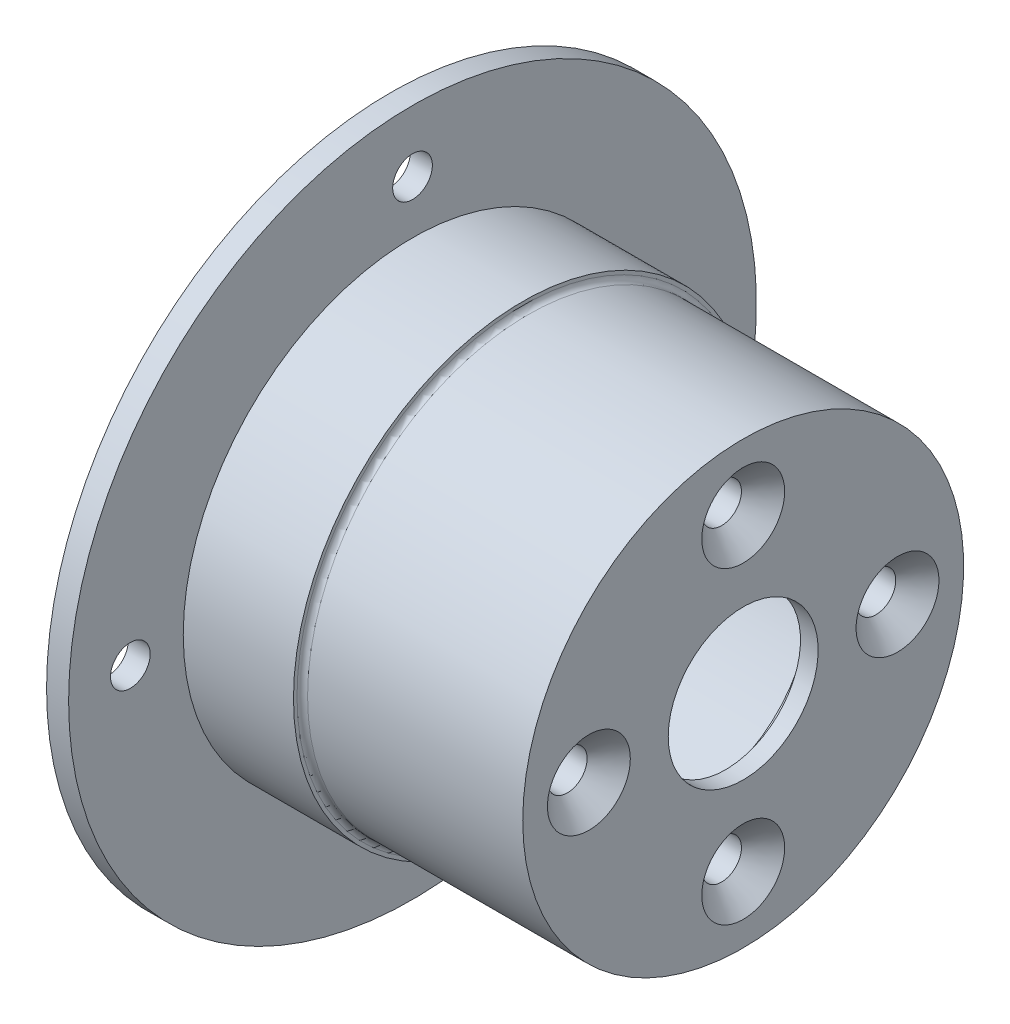
ISO-10303-21;
HEADER;
FILE_DESCRIPTION(('STEP AP214'),'2;1');
FILE_NAME('part.step','',(''),(''),'','','');
FILE_SCHEMA(('AUTOMOTIVE_DESIGN { 1 0 10303 214 1 1 1 1 }'));
ENDSEC;
DATA;
#1=APPLICATION_CONTEXT('core data for automotive mechanical design processes');
#2=APPLICATION_PROTOCOL_DEFINITION('international standard','automotive_design',2000,#1);
#3=PRODUCT_CONTEXT('',#1,'mechanical');
#4=PRODUCT('Part','Part','',(#3));
#5=PRODUCT_RELATED_PRODUCT_CATEGORY('part','',(#4));
#6=PRODUCT_DEFINITION_FORMATION('','',#4);
#7=PRODUCT_DEFINITION_CONTEXT('part definition',#1,'design');
#8=PRODUCT_DEFINITION('design','',#6,#7);
#9=PRODUCT_DEFINITION_SHAPE('','',#8);
#10=(LENGTH_UNIT() NAMED_UNIT(*) SI_UNIT(.MILLI.,.METRE.));
#11=(NAMED_UNIT(*) PLANE_ANGLE_UNIT() SI_UNIT($,.RADIAN.));
#12=(NAMED_UNIT(*) SI_UNIT($,.STERADIAN.) SOLID_ANGLE_UNIT());
#13=UNCERTAINTY_MEASURE_WITH_UNIT(LENGTH_MEASURE(1.E-05),#10,'distance_accuracy_value','');
#14=(GEOMETRIC_REPRESENTATION_CONTEXT(3) GLOBAL_UNCERTAINTY_ASSIGNED_CONTEXT((#13)) GLOBAL_UNIT_ASSIGNED_CONTEXT((#10,
#11,#12)) REPRESENTATION_CONTEXT('',''));
#15=CARTESIAN_POINT('',(0.,0.,0.));
#16=DIRECTION('',(0.,0.,1.));
#17=DIRECTION('',(1.,0.,0.));
#18=AXIS2_PLACEMENT_3D('',#15,#16,#17);
#19=CARTESIAN_POINT('',(0.,39.,0.));
#20=DIRECTION('',(1.,0.,0.));
#21=DIRECTION('',(0.,0.,-1.));
#22=AXIS2_PLACEMENT_3D('',#19,#20,#21);
#23=PLANE('',#22);
#24=CARTESIAN_POINT('',(0.,-32.,0.));
#25=DIRECTION('',(-1.,0.,0.));
#26=DIRECTION('',(0.,0.,1.));
#27=AXIS2_PLACEMENT_3D('',#24,#25,#26);
#28=CIRCLE('',#27,2.25);
#29=CARTESIAN_POINT('',(0.,-32.,2.25));
#30=VERTEX_POINT('',#29);
#31=EDGE_CURVE('E165',#30,#30,#28,.T.);
#32=ORIENTED_EDGE('',*,*,#31,.F.);
#33=EDGE_LOOP('',(#32));
#34=FACE_BOUND('',#33,.T.);
#35=CARTESIAN_POINT('',(0.,0.,-32.));
#36=DIRECTION('',(-1.,0.,0.));
#37=DIRECTION('',(0.,0.,1.));
#38=AXIS2_PLACEMENT_3D('',#35,#36,#37);
#39=CIRCLE('',#38,2.25);
#40=CARTESIAN_POINT('',(0.,0.,-29.75));
#41=VERTEX_POINT('',#40);
#42=EDGE_CURVE('E149',#41,#41,#39,.T.);
#43=ORIENTED_EDGE('',*,*,#42,.F.);
#44=EDGE_LOOP('',(#43));
#45=FACE_BOUND('',#44,.T.);
#46=CARTESIAN_POINT('',(0.,0.,0.));
#47=DIRECTION('',(-1.,0.,0.));
#48=DIRECTION('',(0.,0.,1.));
#49=AXIS2_PLACEMENT_3D('',#46,#47,#48);
#50=CIRCLE('',#49,21.);
#51=CARTESIAN_POINT('',(0.,0.,21.));
#52=VERTEX_POINT('',#51);
#53=EDGE_CURVE('E50',#52,#52,#50,.T.);
#54=ORIENTED_EDGE('',*,*,#53,.F.);
#55=EDGE_LOOP('',(#54));
#56=FACE_BOUND('',#55,.T.);
#57=CARTESIAN_POINT('',(0.,0.,0.));
#58=DIRECTION('',(-1.,0.,0.));
#59=DIRECTION('',(0.,0.,1.));
#60=AXIS2_PLACEMENT_3D('',#57,#58,#59);
#61=CIRCLE('',#60,39.);
#62=CARTESIAN_POINT('',(0.,0.,39.));
#63=VERTEX_POINT('',#62);
#64=EDGE_CURVE('E93',#63,#63,#61,.T.);
#65=ORIENTED_EDGE('',*,*,#64,.T.);
#66=EDGE_LOOP('',(#65));
#67=FACE_BOUND('',#66,.T.);
#68=CARTESIAN_POINT('',(0.,0.,32.));
#69=DIRECTION('',(-1.,0.,0.));
#70=DIRECTION('',(0.,0.,1.));
#71=AXIS2_PLACEMENT_3D('',#68,#69,#70);
#72=CIRCLE('',#71,2.25);
#73=CARTESIAN_POINT('',(0.,0.,34.25));
#74=VERTEX_POINT('',#73);
#75=EDGE_CURVE('E157',#74,#74,#72,.T.);
#76=ORIENTED_EDGE('',*,*,#75,.F.);
#77=EDGE_LOOP('',(#76));
#78=FACE_BOUND('',#77,.T.);
#79=CARTESIAN_POINT('',(0.,32.,0.));
#80=DIRECTION('',(-1.,0.,0.));
#81=DIRECTION('',(0.,0.,1.));
#82=AXIS2_PLACEMENT_3D('',#79,#80,#81);
#83=CIRCLE('',#82,2.25);
#84=CARTESIAN_POINT('',(0.,32.,2.25));
#85=VERTEX_POINT('',#84);
#86=EDGE_CURVE('E173',#85,#85,#83,.T.);
#87=ORIENTED_EDGE('',*,*,#86,.F.);
#88=EDGE_LOOP('',(#87));
#89=FACE_BOUND('',#88,.T.);
#90=ADVANCED_FACE('F37',(#34,#45,#56,#67,#78,#89),#23,.F.);
#91=CARTESIAN_POINT('',(-64.1033524540557,0.,0.));
#92=DIRECTION('',(-1.,0.,0.));
#93=DIRECTION('',(0.,0.,1.));
#94=AXIS2_PLACEMENT_3D('',#91,#92,#93);
#95=CYLINDRICAL_SURFACE('',#94,21.);
#96=CARTESIAN_POINT('',(35.,0.,0.));
#97=DIRECTION('',(-1.,0.,0.));
#98=DIRECTION('',(0.,0.,1.));
#99=AXIS2_PLACEMENT_3D('',#96,#97,#98);
#100=CIRCLE('',#99,21.);
#101=CARTESIAN_POINT('',(35.,0.,21.));
#102=VERTEX_POINT('',#101);
#103=EDGE_CURVE('E55',#102,#102,#100,.T.);
#104=ORIENTED_EDGE('',*,*,#103,.F.);
#105=EDGE_LOOP('',(#104));
#106=FACE_BOUND('',#105,.T.);
#107=ORIENTED_EDGE('',*,*,#53,.T.);
#108=EDGE_LOOP('',(#107));
#109=FACE_BOUND('',#108,.T.);
#110=ADVANCED_FACE('F181',(#106,#109),#95,.F.);
#111=CARTESIAN_POINT('',(35.,21.,0.));
#112=DIRECTION('',(1.,0.,0.));
#113=DIRECTION('',(0.,0.,-1.));
#114=AXIS2_PLACEMENT_3D('',#111,#112,#113);
#115=PLANE('',#114);
#116=CARTESIAN_POINT('',(35.,17.5,0.));
#117=DIRECTION('',(1.,0.,0.));
#118=DIRECTION('',(0.,0.,-1.));
#119=AXIS2_PLACEMENT_3D('',#116,#117,#118);
#120=CIRCLE('',#119,2.24999999999999);
#121=CARTESIAN_POINT('',(35.,17.5,-2.24999999999999));
#122=VERTEX_POINT('',#121);
#123=EDGE_CURVE('E133',#122,#122,#120,.T.);
#124=ORIENTED_EDGE('',*,*,#123,.T.);
#125=EDGE_LOOP('',(#124));
#126=FACE_BOUND('',#125,.T.);
#127=CARTESIAN_POINT('',(35.,0.,-17.5));
#128=DIRECTION('',(1.,0.,0.));
#129=DIRECTION('',(0.,0.,-1.));
#130=AXIS2_PLACEMENT_3D('',#127,#128,#129);
#131=CIRCLE('',#130,2.24999999999999);
#132=CARTESIAN_POINT('',(35.,0.,-19.75));
#133=VERTEX_POINT('',#132);
#134=EDGE_CURVE('E121',#133,#133,#131,.T.);
#135=ORIENTED_EDGE('',*,*,#134,.T.);
#136=EDGE_LOOP('',(#135));
#137=FACE_BOUND('',#136,.T.);
#138=CARTESIAN_POINT('',(35.,-17.5,0.));
#139=DIRECTION('',(1.,0.,0.));
#140=DIRECTION('',(0.,0.,-1.));
#141=AXIS2_PLACEMENT_3D('',#138,#139,#140);
#142=CIRCLE('',#141,2.24999999999999);
#143=CARTESIAN_POINT('',(35.,-17.5,-2.24999999999999));
#144=VERTEX_POINT('',#143);
#145=EDGE_CURVE('E109',#144,#144,#142,.T.);
#146=ORIENTED_EDGE('',*,*,#145,.T.);
#147=EDGE_LOOP('',(#146));
#148=FACE_BOUND('',#147,.T.);
#149=CARTESIAN_POINT('',(35.,0.,17.5));
#150=DIRECTION('',(1.,0.,0.));
#151=DIRECTION('',(0.,0.,-1.));
#152=AXIS2_PLACEMENT_3D('',#149,#150,#151);
#153=CIRCLE('',#152,2.24999999999999);
#154=CARTESIAN_POINT('',(35.,0.,15.25));
#155=VERTEX_POINT('',#154);
#156=EDGE_CURVE('E97',#155,#155,#153,.T.);
#157=ORIENTED_EDGE('',*,*,#156,.T.);
#158=EDGE_LOOP('',(#157));
#159=FACE_BOUND('',#158,.T.);
#160=CARTESIAN_POINT('',(35.,0.,0.));
#161=DIRECTION('',(-1.,0.,0.));
#162=DIRECTION('',(0.,0.,1.));
#163=AXIS2_PLACEMENT_3D('',#160,#161,#162);
#164=CIRCLE('',#163,12.5);
#165=CARTESIAN_POINT('',(35.,0.,12.5));
#166=VERTEX_POINT('',#165);
#167=EDGE_CURVE('E61',#166,#166,#164,.T.);
#168=ORIENTED_EDGE('',*,*,#167,.F.);
#169=EDGE_LOOP('',(#168));
#170=FACE_BOUND('',#169,.T.);
#171=ORIENTED_EDGE('',*,*,#103,.T.);
#172=EDGE_LOOP('',(#171));
#173=FACE_BOUND('',#172,.T.);
#174=ADVANCED_FACE('F187',(#126,#137,#148,#159,#170,#173),#115,.F.);
#175=CARTESIAN_POINT('',(-64.1033524540557,0.,0.));
#176=DIRECTION('',(-1.,0.,0.));
#177=DIRECTION('',(0.,0.,1.));
#178=AXIS2_PLACEMENT_3D('',#175,#176,#177);
#179=CYLINDRICAL_SURFACE('',#178,12.5);
#180=CARTESIAN_POINT('',(38.,0.,0.));
#181=DIRECTION('',(-1.,0.,0.));
#182=DIRECTION('',(0.,0.,1.));
#183=AXIS2_PLACEMENT_3D('',#180,#181,#182);
#184=CIRCLE('',#183,12.5);
#185=CARTESIAN_POINT('',(38.,0.,12.5));
#186=VERTEX_POINT('',#185);
#187=EDGE_CURVE('E65',#186,#186,#184,.T.);
#188=ORIENTED_EDGE('',*,*,#187,.F.);
#189=EDGE_LOOP('',(#188));
#190=FACE_BOUND('',#189,.T.);
#191=ORIENTED_EDGE('',*,*,#167,.T.);
#192=EDGE_LOOP('',(#191));
#193=FACE_BOUND('',#192,.T.);
#194=ADVANCED_FACE('F224',(#190,#193),#179,.F.);
#195=CARTESIAN_POINT('',(38.,12.5,0.));
#196=DIRECTION('',(1.,0.,0.));
#197=DIRECTION('',(0.,0.,-1.));
#198=AXIS2_PLACEMENT_3D('',#195,#196,#197);
#199=PLANE('',#198);
#200=CARTESIAN_POINT('',(38.,0.,0.));
#201=DIRECTION('',(-1.,0.,0.));
#202=DIRECTION('',(0.,0.,1.));
#203=AXIS2_PLACEMENT_3D('',#200,#201,#202);
#204=CIRCLE('',#203,8.5);
#205=CARTESIAN_POINT('',(38.,0.,8.5));
#206=VERTEX_POINT('',#205);
#207=EDGE_CURVE('E69',#206,#206,#204,.T.);
#208=ORIENTED_EDGE('',*,*,#207,.F.);
#209=EDGE_LOOP('',(#208));
#210=FACE_BOUND('',#209,.T.);
#211=ORIENTED_EDGE('',*,*,#187,.T.);
#212=EDGE_LOOP('',(#211));
#213=FACE_BOUND('',#212,.T.);
#214=ADVANCED_FACE('F220',(#210,#213),#199,.F.);
#215=CARTESIAN_POINT('',(-64.1033524540557,0.,0.));
#216=DIRECTION('',(-1.,0.,0.));
#217=DIRECTION('',(0.,0.,1.));
#218=AXIS2_PLACEMENT_3D('',#215,#216,#217);
#219=CYLINDRICAL_SURFACE('',#218,8.5);
#220=CARTESIAN_POINT('',(40.,0.,0.));
#221=DIRECTION('',(-1.,0.,0.));
#222=DIRECTION('',(0.,0.,1.));
#223=AXIS2_PLACEMENT_3D('',#220,#221,#222);
#224=CIRCLE('',#223,8.5);
#225=CARTESIAN_POINT('',(40.,0.,8.5));
#226=VERTEX_POINT('',#225);
#227=EDGE_CURVE('E73',#226,#226,#224,.T.);
#228=ORIENTED_EDGE('',*,*,#227,.F.);
#229=EDGE_LOOP('',(#228));
#230=FACE_BOUND('',#229,.T.);
#231=ORIENTED_EDGE('',*,*,#207,.T.);
#232=EDGE_LOOP('',(#231));
#233=FACE_BOUND('',#232,.T.);
#234=ADVANCED_FACE('F216',(#230,#233),#219,.F.);
#235=CARTESIAN_POINT('',(40.,8.5,0.));
#236=DIRECTION('',(-1.,0.,0.));
#237=DIRECTION('',(0.,0.,1.));
#238=AXIS2_PLACEMENT_3D('',#235,#236,#237);
#239=PLANE('',#238);
#240=CARTESIAN_POINT('',(40.,17.5,0.));
#241=DIRECTION('',(1.,0.,0.));
#242=DIRECTION('',(0.,0.,-1.));
#243=AXIS2_PLACEMENT_3D('',#240,#241,#242);
#244=CIRCLE('',#243,4.7);
#245=CARTESIAN_POINT('',(40.,17.5,-4.7));
#246=VERTEX_POINT('',#245);
#247=EDGE_CURVE('E141',#246,#246,#244,.T.);
#248=ORIENTED_EDGE('',*,*,#247,.F.);
#249=EDGE_LOOP('',(#248));
#250=FACE_BOUND('',#249,.T.);
#251=CARTESIAN_POINT('',(40.,0.,-17.5));
#252=DIRECTION('',(1.,0.,0.));
#253=DIRECTION('',(0.,0.,-1.));
#254=AXIS2_PLACEMENT_3D('',#251,#252,#253);
#255=CIRCLE('',#254,4.7);
#256=CARTESIAN_POINT('',(40.,0.,-22.2));
#257=VERTEX_POINT('',#256);
#258=EDGE_CURVE('E129',#257,#257,#255,.T.);
#259=ORIENTED_EDGE('',*,*,#258,.F.);
#260=EDGE_LOOP('',(#259));
#261=FACE_BOUND('',#260,.T.);
#262=CARTESIAN_POINT('',(40.,-17.5,0.));
#263=DIRECTION('',(1.,0.,0.));
#264=DIRECTION('',(0.,0.,-1.));
#265=AXIS2_PLACEMENT_3D('',#262,#263,#264);
#266=CIRCLE('',#265,4.7);
#267=CARTESIAN_POINT('',(40.,-17.5,-4.7));
#268=VERTEX_POINT('',#267);
#269=EDGE_CURVE('E117',#268,#268,#266,.T.);
#270=ORIENTED_EDGE('',*,*,#269,.F.);
#271=EDGE_LOOP('',(#270));
#272=FACE_BOUND('',#271,.T.);
#273=CARTESIAN_POINT('',(40.,0.,17.5));
#274=DIRECTION('',(1.,0.,0.));
#275=DIRECTION('',(0.,0.,-1.));
#276=AXIS2_PLACEMENT_3D('',#273,#274,#275);
#277=CIRCLE('',#276,4.7);
#278=CARTESIAN_POINT('',(40.,0.,12.8));
#279=VERTEX_POINT('',#278);
#280=EDGE_CURVE('E105',#279,#279,#277,.T.);
#281=ORIENTED_EDGE('',*,*,#280,.F.);
#282=EDGE_LOOP('',(#281));
#283=FACE_BOUND('',#282,.T.);
#284=CARTESIAN_POINT('',(40.,0.,0.));
#285=DIRECTION('',(-1.,0.,0.));
#286=DIRECTION('',(0.,0.,1.));
#287=AXIS2_PLACEMENT_3D('',#284,#285,#286);
#288=CIRCLE('',#287,25.);
#289=CARTESIAN_POINT('',(40.,0.,25.));
#290=VERTEX_POINT('',#289);
#291=EDGE_CURVE('E77',#290,#290,#288,.T.);
#292=ORIENTED_EDGE('',*,*,#291,.F.);
#293=EDGE_LOOP('',(#292));
#294=FACE_BOUND('',#293,.T.);
#295=ORIENTED_EDGE('',*,*,#227,.T.);
#296=EDGE_LOOP('',(#295));
#297=FACE_BOUND('',#296,.T.);
#298=ADVANCED_FACE('F213',(#250,#261,#272,#283,#294,#297),#239,.F.);
#299=CARTESIAN_POINT('',(-64.1033524540557,0.,0.));
#300=DIRECTION('',(-1.,0.,0.));
#301=DIRECTION('',(0.,0.,1.));
#302=AXIS2_PLACEMENT_3D('',#299,#300,#301);
#303=CYLINDRICAL_SURFACE('',#302,25.);
#304=CARTESIAN_POINT('',(15.6,0.,0.));
#305=DIRECTION('',(-1.,0.,0.));
#306=DIRECTION('',(0.,0.,1.));
#307=AXIS2_PLACEMENT_3D('',#304,#305,#306);
#308=CIRCLE('',#307,25.);
#309=CARTESIAN_POINT('',(15.6,0.,25.));
#310=VERTEX_POINT('',#309);
#311=EDGE_CURVE('E10',#310,#310,#308,.F.);
#312=ORIENTED_EDGE('',*,*,#311,.T.);
#313=EDGE_LOOP('',(#312));
#314=FACE_BOUND('',#313,.T.);
#315=ORIENTED_EDGE('',*,*,#291,.T.);
#316=EDGE_LOOP('',(#315));
#317=FACE_BOUND('',#316,.T.);
#318=ADVANCED_FACE('F210',(#314,#317),#303,.T.);
#319=CARTESIAN_POINT('',(15.,25.,0.));
#320=DIRECTION('',(-1.,0.,0.));
#321=DIRECTION('',(0.,0.,1.));
#322=AXIS2_PLACEMENT_3D('',#319,#320,#321);
#323=PLANE('',#322);
#324=CARTESIAN_POINT('',(15.,0.,0.));
#325=DIRECTION('',(-1.,0.,0.));
#326=DIRECTION('',(0.,0.,1.));
#327=AXIS2_PLACEMENT_3D('',#324,#325,#326);
#328=CIRCLE('',#327,25.6);
#329=CARTESIAN_POINT('',(15.,0.,25.6));
#330=VERTEX_POINT('',#329);
#331=EDGE_CURVE('E45',#330,#330,#328,.T.);
#332=ORIENTED_EDGE('',*,*,#331,.T.);
#333=EDGE_LOOP('',(#332));
#334=FACE_BOUND('',#333,.T.);
#335=CARTESIAN_POINT('',(15.,0.,0.));
#336=DIRECTION('',(-1.,0.,0.));
#337=DIRECTION('',(0.,0.,1.));
#338=AXIS2_PLACEMENT_3D('',#335,#336,#337);
#339=CIRCLE('',#338,26.);
#340=CARTESIAN_POINT('',(15.,0.,26.));
#341=VERTEX_POINT('',#340);
#342=EDGE_CURVE('E81',#341,#341,#339,.T.);
#343=ORIENTED_EDGE('',*,*,#342,.F.);
#344=EDGE_LOOP('',(#343));
#345=FACE_BOUND('',#344,.T.);
#346=ADVANCED_FACE('F206',(#334,#345),#323,.F.);
#347=CARTESIAN_POINT('',(-64.1033524540557,0.,0.));
#348=DIRECTION('',(-1.,0.,0.));
#349=DIRECTION('',(0.,0.,1.));
#350=AXIS2_PLACEMENT_3D('',#347,#348,#349);
#351=CYLINDRICAL_SURFACE('',#350,26.);
#352=CARTESIAN_POINT('',(2.5,0.,0.));
#353=DIRECTION('',(-1.,0.,0.));
#354=DIRECTION('',(0.,0.,1.));
#355=AXIS2_PLACEMENT_3D('',#352,#353,#354);
#356=CIRCLE('',#355,26.);
#357=CARTESIAN_POINT('',(2.5,0.,26.));
#358=VERTEX_POINT('',#357);
#359=EDGE_CURVE('E85',#358,#358,#356,.T.);
#360=ORIENTED_EDGE('',*,*,#359,.F.);
#361=EDGE_LOOP('',(#360));
#362=FACE_BOUND('',#361,.T.);
#363=ORIENTED_EDGE('',*,*,#342,.T.);
#364=EDGE_LOOP('',(#363));
#365=FACE_BOUND('',#364,.T.);
#366=ADVANCED_FACE('F202',(#362,#365),#351,.T.);
#367=CARTESIAN_POINT('',(2.5,26.,0.));
#368=DIRECTION('',(-1.,0.,0.));
#369=DIRECTION('',(0.,0.,1.));
#370=AXIS2_PLACEMENT_3D('',#367,#368,#369);
#371=PLANE('',#370);
#372=CARTESIAN_POINT('',(2.5,32.,0.));
#373=DIRECTION('',(-1.,0.,0.));
#374=DIRECTION('',(0.,0.,1.));
#375=AXIS2_PLACEMENT_3D('',#372,#373,#374);
#376=CIRCLE('',#375,2.25);
#377=CARTESIAN_POINT('',(2.5,32.,2.25));
#378=VERTEX_POINT('',#377);
#379=EDGE_CURVE('E169',#378,#378,#376,.T.);
#380=ORIENTED_EDGE('',*,*,#379,.T.);
#381=EDGE_LOOP('',(#380));
#382=FACE_BOUND('',#381,.T.);
#383=CARTESIAN_POINT('',(2.5,-32.,0.));
#384=DIRECTION('',(-1.,0.,0.));
#385=DIRECTION('',(0.,0.,1.));
#386=AXIS2_PLACEMENT_3D('',#383,#384,#385);
#387=CIRCLE('',#386,2.25);
#388=CARTESIAN_POINT('',(2.5,-32.,2.25));
#389=VERTEX_POINT('',#388);
#390=EDGE_CURVE('E161',#389,#389,#387,.T.);
#391=ORIENTED_EDGE('',*,*,#390,.T.);
#392=EDGE_LOOP('',(#391));
#393=FACE_BOUND('',#392,.T.);
#394=CARTESIAN_POINT('',(2.5,0.,32.));
#395=DIRECTION('',(-1.,0.,0.));
#396=DIRECTION('',(0.,0.,1.));
#397=AXIS2_PLACEMENT_3D('',#394,#395,#396);
#398=CIRCLE('',#397,2.25);
#399=CARTESIAN_POINT('',(2.5,0.,34.25));
#400=VERTEX_POINT('',#399);
#401=EDGE_CURVE('E153',#400,#400,#398,.T.);
#402=ORIENTED_EDGE('',*,*,#401,.T.);
#403=EDGE_LOOP('',(#402));
#404=FACE_BOUND('',#403,.T.);
#405=CARTESIAN_POINT('',(2.5,0.,-32.));
#406=DIRECTION('',(-1.,0.,0.));
#407=DIRECTION('',(0.,0.,1.));
#408=AXIS2_PLACEMENT_3D('',#405,#406,#407);
#409=CIRCLE('',#408,2.25);
#410=CARTESIAN_POINT('',(2.5,0.,-29.75));
#411=VERTEX_POINT('',#410);
#412=EDGE_CURVE('E145',#411,#411,#409,.T.);
#413=ORIENTED_EDGE('',*,*,#412,.T.);
#414=EDGE_LOOP('',(#413));
#415=FACE_BOUND('',#414,.T.);
#416=CARTESIAN_POINT('',(2.5,0.,0.));
#417=DIRECTION('',(-1.,0.,0.));
#418=DIRECTION('',(0.,0.,1.));
#419=AXIS2_PLACEMENT_3D('',#416,#417,#418);
#420=CIRCLE('',#419,39.);
#421=CARTESIAN_POINT('',(2.5,0.,39.));
#422=VERTEX_POINT('',#421);
#423=EDGE_CURVE('E89',#422,#422,#420,.T.);
#424=ORIENTED_EDGE('',*,*,#423,.F.);
#425=EDGE_LOOP('',(#424));
#426=FACE_BOUND('',#425,.T.);
#427=ORIENTED_EDGE('',*,*,#359,.T.);
#428=EDGE_LOOP('',(#427));
#429=FACE_BOUND('',#428,.T.);
#430=ADVANCED_FACE('F198',(#382,#393,#404,#415,#426,#429),#371,.F.);
#431=CARTESIAN_POINT('',(-64.1033524540557,0.,0.));
#432=DIRECTION('',(-1.,0.,0.));
#433=DIRECTION('',(0.,0.,1.));
#434=AXIS2_PLACEMENT_3D('',#431,#432,#433);
#435=CYLINDRICAL_SURFACE('',#434,39.);
#436=ORIENTED_EDGE('',*,*,#64,.F.);
#437=EDGE_LOOP('',(#436));
#438=FACE_BOUND('',#437,.T.);
#439=ORIENTED_EDGE('',*,*,#423,.T.);
#440=EDGE_LOOP('',(#439));
#441=FACE_BOUND('',#440,.T.);
#442=ADVANCED_FACE('F195',(#438,#441),#435,.T.);
#443=CARTESIAN_POINT('',(40.,0.,17.5));
#444=DIRECTION('',(1.,0.,0.));
#445=DIRECTION('',(0.,0.,-1.));
#446=AXIS2_PLACEMENT_3D('',#443,#444,#445);
#447=CYLINDRICAL_SURFACE('',#446,2.24999999999999);
#448=ORIENTED_EDGE('',*,*,#156,.F.);
#449=EDGE_LOOP('',(#448));
#450=FACE_BOUND('',#449,.T.);
#451=CARTESIAN_POINT('',(37.55,0.,17.5));
#452=DIRECTION('',(1.,0.,0.));
#453=DIRECTION('',(0.,0.,-1.));
#454=AXIS2_PLACEMENT_3D('',#451,#452,#453);
#455=CIRCLE('',#454,2.24999999999999);
#456=CARTESIAN_POINT('',(37.55,0.,15.25));
#457=VERTEX_POINT('',#456);
#458=EDGE_CURVE('E101',#457,#457,#455,.T.);
#459=ORIENTED_EDGE('',*,*,#458,.T.);
#460=EDGE_LOOP('',(#459));
#461=FACE_BOUND('',#460,.T.);
#462=ADVANCED_FACE('F193',(#450,#461),#447,.F.);
#463=CARTESIAN_POINT('',(40.,0.,17.5));
#464=DIRECTION('',(1.,0.,0.));
#465=DIRECTION('',(0.,0.,-1.));
#466=AXIS2_PLACEMENT_3D('',#463,#464,#465);
#467=CONICAL_SURFACE('',#466,4.7,0.785398163397449);
#468=ORIENTED_EDGE('',*,*,#458,.F.);
#469=EDGE_LOOP('',(#468));
#470=FACE_BOUND('',#469,.T.);
#471=ORIENTED_EDGE('',*,*,#280,.T.);
#472=EDGE_LOOP('',(#471));
#473=FACE_BOUND('',#472,.T.);
#474=ADVANCED_FACE('F291',(#470,#473),#467,.F.);
#475=CARTESIAN_POINT('',(40.,-17.5,0.));
#476=DIRECTION('',(1.,0.,0.));
#477=DIRECTION('',(0.,0.,-1.));
#478=AXIS2_PLACEMENT_3D('',#475,#476,#477);
#479=CYLINDRICAL_SURFACE('',#478,2.24999999999999);
#480=ORIENTED_EDGE('',*,*,#145,.F.);
#481=EDGE_LOOP('',(#480));
#482=FACE_BOUND('',#481,.T.);
#483=CARTESIAN_POINT('',(37.55,-17.5,0.));
#484=DIRECTION('',(1.,0.,0.));
#485=DIRECTION('',(0.,0.,-1.));
#486=AXIS2_PLACEMENT_3D('',#483,#484,#485);
#487=CIRCLE('',#486,2.24999999999999);
#488=CARTESIAN_POINT('',(37.55,-17.5,-2.24999999999999));
#489=VERTEX_POINT('',#488);
#490=EDGE_CURVE('E113',#489,#489,#487,.T.);
#491=ORIENTED_EDGE('',*,*,#490,.T.);
#492=EDGE_LOOP('',(#491));
#493=FACE_BOUND('',#492,.T.);
#494=ADVANCED_FACE('F288',(#482,#493),#479,.F.);
#495=CARTESIAN_POINT('',(40.,-17.5,0.));
#496=DIRECTION('',(1.,0.,0.));
#497=DIRECTION('',(0.,0.,-1.));
#498=AXIS2_PLACEMENT_3D('',#495,#496,#497);
#499=CONICAL_SURFACE('',#498,4.7,0.785398163397449);
#500=ORIENTED_EDGE('',*,*,#490,.F.);
#501=EDGE_LOOP('',(#500));
#502=FACE_BOUND('',#501,.T.);
#503=ORIENTED_EDGE('',*,*,#269,.T.);
#504=EDGE_LOOP('',(#503));
#505=FACE_BOUND('',#504,.T.);
#506=ADVANCED_FACE('F284',(#502,#505),#499,.F.);
#507=CARTESIAN_POINT('',(40.,0.,-17.5));
#508=DIRECTION('',(1.,0.,0.));
#509=DIRECTION('',(0.,0.,-1.));
#510=AXIS2_PLACEMENT_3D('',#507,#508,#509);
#511=CYLINDRICAL_SURFACE('',#510,2.24999999999999);
#512=ORIENTED_EDGE('',*,*,#134,.F.);
#513=EDGE_LOOP('',(#512));
#514=FACE_BOUND('',#513,.T.);
#515=CARTESIAN_POINT('',(37.55,0.,-17.5));
#516=DIRECTION('',(1.,0.,0.));
#517=DIRECTION('',(0.,0.,-1.));
#518=AXIS2_PLACEMENT_3D('',#515,#516,#517);
#519=CIRCLE('',#518,2.24999999999999);
#520=CARTESIAN_POINT('',(37.55,0.,-19.75));
#521=VERTEX_POINT('',#520);
#522=EDGE_CURVE('E125',#521,#521,#519,.T.);
#523=ORIENTED_EDGE('',*,*,#522,.T.);
#524=EDGE_LOOP('',(#523));
#525=FACE_BOUND('',#524,.T.);
#526=ADVANCED_FACE('F280',(#514,#525),#511,.F.);
#527=CARTESIAN_POINT('',(40.,0.,-17.5));
#528=DIRECTION('',(1.,0.,0.));
#529=DIRECTION('',(0.,0.,-1.));
#530=AXIS2_PLACEMENT_3D('',#527,#528,#529);
#531=CONICAL_SURFACE('',#530,4.7,0.785398163397449);
#532=ORIENTED_EDGE('',*,*,#522,.F.);
#533=EDGE_LOOP('',(#532));
#534=FACE_BOUND('',#533,.T.);
#535=ORIENTED_EDGE('',*,*,#258,.T.);
#536=EDGE_LOOP('',(#535));
#537=FACE_BOUND('',#536,.T.);
#538=ADVANCED_FACE('F276',(#534,#537),#531,.F.);
#539=CARTESIAN_POINT('',(40.,17.5,0.));
#540=DIRECTION('',(1.,0.,0.));
#541=DIRECTION('',(0.,0.,-1.));
#542=AXIS2_PLACEMENT_3D('',#539,#540,#541);
#543=CYLINDRICAL_SURFACE('',#542,2.24999999999999);
#544=ORIENTED_EDGE('',*,*,#123,.F.);
#545=EDGE_LOOP('',(#544));
#546=FACE_BOUND('',#545,.T.);
#547=CARTESIAN_POINT('',(37.55,17.5,0.));
#548=DIRECTION('',(1.,0.,0.));
#549=DIRECTION('',(0.,0.,-1.));
#550=AXIS2_PLACEMENT_3D('',#547,#548,#549);
#551=CIRCLE('',#550,2.24999999999999);
#552=CARTESIAN_POINT('',(37.55,17.5,-2.24999999999999));
#553=VERTEX_POINT('',#552);
#554=EDGE_CURVE('E137',#553,#553,#551,.T.);
#555=ORIENTED_EDGE('',*,*,#554,.T.);
#556=EDGE_LOOP('',(#555));
#557=FACE_BOUND('',#556,.T.);
#558=ADVANCED_FACE('F272',(#546,#557),#543,.F.);
#559=CARTESIAN_POINT('',(40.,17.5,0.));
#560=DIRECTION('',(1.,0.,0.));
#561=DIRECTION('',(0.,0.,-1.));
#562=AXIS2_PLACEMENT_3D('',#559,#560,#561);
#563=CONICAL_SURFACE('',#562,4.7,0.785398163397449);
#564=ORIENTED_EDGE('',*,*,#554,.F.);
#565=EDGE_LOOP('',(#564));
#566=FACE_BOUND('',#565,.T.);
#567=ORIENTED_EDGE('',*,*,#247,.T.);
#568=EDGE_LOOP('',(#567));
#569=FACE_BOUND('',#568,.T.);
#570=ADVANCED_FACE('F269',(#566,#569),#563,.F.);
#571=CARTESIAN_POINT('',(15.6,0.,0.));
#572=DIRECTION('',(-1.,0.,0.));
#573=DIRECTION('',(0.,0.,1.));
#574=AXIS2_PLACEMENT_3D('',#571,#572,#573);
#575=TOROIDAL_SURFACE('',#574,25.6,0.6);
#576=ORIENTED_EDGE('',*,*,#311,.F.);
#577=EDGE_LOOP('',(#576));
#578=FACE_BOUND('',#577,.T.);
#579=ORIENTED_EDGE('',*,*,#331,.F.);
#580=EDGE_LOOP('',(#579));
#581=FACE_BOUND('',#580,.T.);
#582=ADVANCED_FACE('F39',(#578,#581),#575,.F.);
#583=CARTESIAN_POINT('',(0.,0.,-32.));
#584=DIRECTION('',(-1.,0.,0.));
#585=DIRECTION('',(0.,0.,1.));
#586=AXIS2_PLACEMENT_3D('',#583,#584,#585);
#587=CYLINDRICAL_SURFACE('',#586,2.25);
#588=ORIENTED_EDGE('',*,*,#412,.F.);
#589=EDGE_LOOP('',(#588));
#590=FACE_BOUND('',#589,.T.);
#591=ORIENTED_EDGE('',*,*,#42,.T.);
#592=EDGE_LOOP('',(#591));
#593=FACE_BOUND('',#592,.T.);
#594=ADVANCED_FACE('F255',(#590,#593),#587,.F.);
#595=CARTESIAN_POINT('',(0.,0.,32.));
#596=DIRECTION('',(-1.,0.,0.));
#597=DIRECTION('',(0.,0.,1.));
#598=AXIS2_PLACEMENT_3D('',#595,#596,#597);
#599=CYLINDRICAL_SURFACE('',#598,2.25);
#600=ORIENTED_EDGE('',*,*,#401,.F.);
#601=EDGE_LOOP('',(#600));
#602=FACE_BOUND('',#601,.T.);
#603=ORIENTED_EDGE('',*,*,#75,.T.);
#604=EDGE_LOOP('',(#603));
#605=FACE_BOUND('',#604,.T.);
#606=ADVANCED_FACE('F252',(#602,#605),#599,.F.);
#607=CARTESIAN_POINT('',(0.,-32.,0.));
#608=DIRECTION('',(-1.,0.,0.));
#609=DIRECTION('',(0.,0.,1.));
#610=AXIS2_PLACEMENT_3D('',#607,#608,#609);
#611=CYLINDRICAL_SURFACE('',#610,2.25);
#612=ORIENTED_EDGE('',*,*,#390,.F.);
#613=EDGE_LOOP('',(#612));
#614=FACE_BOUND('',#613,.T.);
#615=ORIENTED_EDGE('',*,*,#31,.T.);
#616=EDGE_LOOP('',(#615));
#617=FACE_BOUND('',#616,.T.);
#618=ADVANCED_FACE('F254',(#614,#617),#611,.F.);
#619=CARTESIAN_POINT('',(0.,32.,0.));
#620=DIRECTION('',(-1.,0.,0.));
#621=DIRECTION('',(0.,0.,1.));
#622=AXIS2_PLACEMENT_3D('',#619,#620,#621);
#623=CYLINDRICAL_SURFACE('',#622,2.25);
#624=ORIENTED_EDGE('',*,*,#379,.F.);
#625=EDGE_LOOP('',(#624));
#626=FACE_BOUND('',#625,.T.);
#627=ORIENTED_EDGE('',*,*,#86,.T.);
#628=EDGE_LOOP('',(#627));
#629=FACE_BOUND('',#628,.T.);
#630=ADVANCED_FACE('F178',(#626,#629),#623,.F.);
#631=CLOSED_SHELL('',(#90,#110,#174,#194,#214,#234,#298,#318,#346,#366,#430,#442,#462,#474,#494,
#506,#526,#538,#558,#570,#582,#594,#606,#618,#630));
#632=MANIFOLD_SOLID_BREP('B2',#631);
#633=ADVANCED_BREP_SHAPE_REPRESENTATION('',(#18,#632),#14);
#634=SHAPE_DEFINITION_REPRESENTATION(#9,#633);
ENDSEC;
END-ISO-10303-21;
